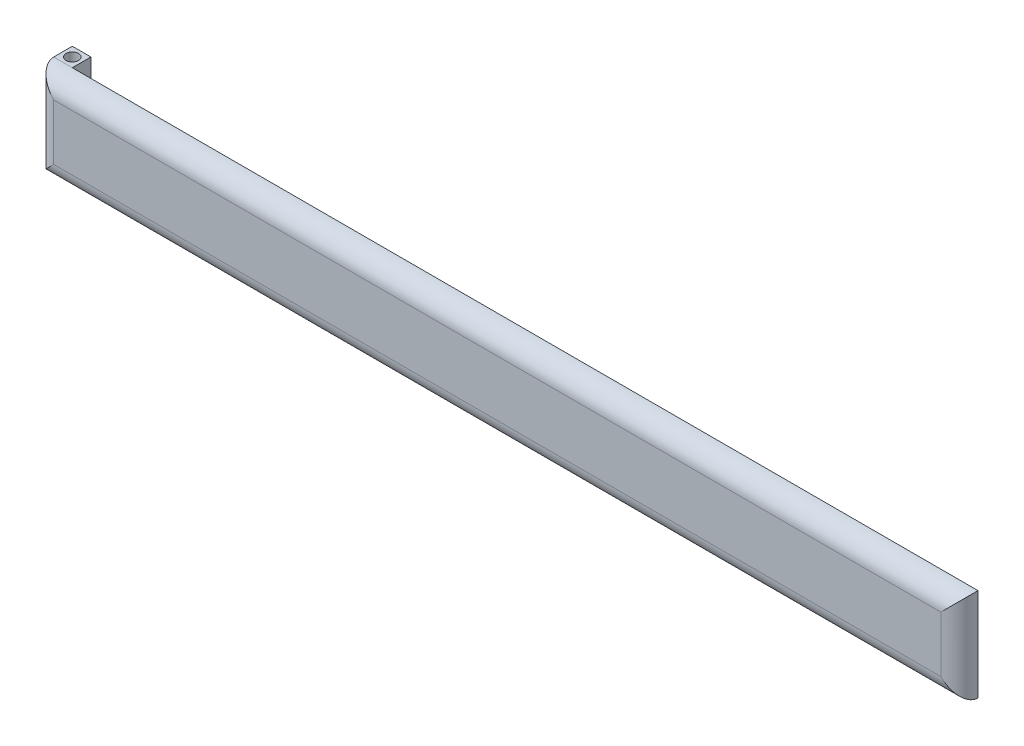
ISO-10303-21;
HEADER;
FILE_DESCRIPTION(('STEP AP214'),'2;1');
FILE_NAME('part.step','',(''),(''),'','','');
FILE_SCHEMA(('AUTOMOTIVE_DESIGN { 1 0 10303 214 1 1 1 1 }'));
ENDSEC;
DATA;
#1=APPLICATION_CONTEXT('core data for automotive mechanical design processes');
#2=APPLICATION_PROTOCOL_DEFINITION('international standard','automotive_design',2000,#1);
#3=PRODUCT_CONTEXT('',#1,'mechanical');
#4=PRODUCT('Part','Part','',(#3));
#5=PRODUCT_RELATED_PRODUCT_CATEGORY('part','',(#4));
#6=PRODUCT_DEFINITION_FORMATION('','',#4);
#7=PRODUCT_DEFINITION_CONTEXT('part definition',#1,'design');
#8=PRODUCT_DEFINITION('design','',#6,#7);
#9=PRODUCT_DEFINITION_SHAPE('','',#8);
#10=(LENGTH_UNIT() NAMED_UNIT(*) SI_UNIT(.MILLI.,.METRE.));
#11=(NAMED_UNIT(*) PLANE_ANGLE_UNIT() SI_UNIT($,.RADIAN.));
#12=(NAMED_UNIT(*) SI_UNIT($,.STERADIAN.) SOLID_ANGLE_UNIT());
#13=UNCERTAINTY_MEASURE_WITH_UNIT(LENGTH_MEASURE(1.E-05),#10,'distance_accuracy_value','');
#14=(GEOMETRIC_REPRESENTATION_CONTEXT(3) GLOBAL_UNCERTAINTY_ASSIGNED_CONTEXT((#13)) GLOBAL_UNIT_ASSIGNED_CONTEXT((#10,
#11,#12)) REPRESENTATION_CONTEXT('',''));
#15=CARTESIAN_POINT('',(0.,0.,0.));
#16=DIRECTION('',(0.,0.,1.));
#17=DIRECTION('',(1.,0.,0.));
#18=AXIS2_PLACEMENT_3D('',#15,#16,#17);
#19=CARTESIAN_POINT('',(1.5,7.5,6.));
#20=DIRECTION('',(-1.,0.,0.));
#21=DIRECTION('',(0.,-1.,0.));
#22=AXIS2_PLACEMENT_3D('',#19,#20,#21);
#23=PLANE('',#22);
#24=DIRECTION('',(0.,1.,0.));
#25=VECTOR('',#24,1.);
#26=CARTESIAN_POINT('',(1.5,-7.5,3.));
#27=LINE('',#26,#25);
#28=CARTESIAN_POINT('',(1.5,-7.5,3.));
#29=VERTEX_POINT('',#28);
#30=CARTESIAN_POINT('',(1.5,7.5,3.));
#31=VERTEX_POINT('',#30);
#32=EDGE_CURVE('E105',#29,#31,#27,.T.);
#33=ORIENTED_EDGE('',*,*,#32,.F.);
#34=DIRECTION('',(0.,0.,-1.));
#35=VECTOR('',#34,1.);
#36=CARTESIAN_POINT('',(1.5,-7.5,6.));
#37=LINE('',#36,#35);
#38=CARTESIAN_POINT('',(1.5,-7.5,0.));
#39=VERTEX_POINT('',#38);
#40=EDGE_CURVE('E169',#29,#39,#37,.T.);
#41=ORIENTED_EDGE('',*,*,#40,.T.);
#42=DIRECTION('',(0.,1.,0.));
#43=VECTOR('',#42,1.);
#44=CARTESIAN_POINT('',(1.5,7.5,0.));
#45=LINE('',#44,#43);
#46=CARTESIAN_POINT('',(1.5,7.5,0.));
#47=VERTEX_POINT('',#46);
#48=EDGE_CURVE('E115',#39,#47,#45,.T.);
#49=ORIENTED_EDGE('',*,*,#48,.T.);
#50=DIRECTION('',(0.,0.,-1.));
#51=VECTOR('',#50,1.);
#52=CARTESIAN_POINT('',(1.5,7.5,6.));
#53=LINE('',#52,#51);
#54=EDGE_CURVE('E132',#31,#47,#53,.T.);
#55=ORIENTED_EDGE('',*,*,#54,.F.);
#56=EDGE_LOOP('',(#33,#41,#49,#55));
#57=FACE_BOUND('',#56,.T.);
#58=ADVANCED_FACE('F32',(#57),#23,.F.);
#59=CARTESIAN_POINT('',(-1.5,7.5,6.));
#60=DIRECTION('',(0.,-1.,0.));
#61=DIRECTION('',(0.,0.,-1.));
#62=AXIS2_PLACEMENT_3D('',#59,#60,#61);
#63=PLANE('',#62);
#64=CARTESIAN_POINT('',(0.,7.5,1.5));
#65=DIRECTION('',(0.,1.,0.));
#66=DIRECTION('',(0.,0.,1.));
#67=AXIS2_PLACEMENT_3D('',#64,#65,#66);
#68=CIRCLE('',#67,1.);
#69=CARTESIAN_POINT('',(0.,7.5,2.5));
#70=VERTEX_POINT('',#69);
#71=EDGE_CURVE('E129',#70,#70,#68,.T.);
#72=ORIENTED_EDGE('',*,*,#71,.F.);
#73=EDGE_LOOP('',(#72));
#74=FACE_BOUND('',#73,.T.);
#75=DIRECTION('',(0.,0.,-1.));
#76=VECTOR('',#75,1.);
#77=CARTESIAN_POINT('',(-1.5,7.5,6.));
#78=LINE('',#77,#76);
#79=CARTESIAN_POINT('',(-1.5,7.5,3.));
#80=VERTEX_POINT('',#79);
#81=CARTESIAN_POINT('',(-1.5,7.5,0.));
#82=VERTEX_POINT('',#81);
#83=EDGE_CURVE('E161',#80,#82,#78,.T.);
#84=ORIENTED_EDGE('',*,*,#83,.F.);
#85=DIRECTION('',(-1.,0.,0.));
#86=VECTOR('',#85,1.);
#87=CARTESIAN_POINT('',(147.5,7.5,3.));
#88=LINE('',#87,#86);
#89=EDGE_CURVE('E41',#80,#31,#88,.F.);
#90=ORIENTED_EDGE('',*,*,#89,.T.);
#91=ORIENTED_EDGE('',*,*,#54,.T.);
#92=DIRECTION('',(-1.,0.,0.));
#93=VECTOR('',#92,1.);
#94=CARTESIAN_POINT('',(-1.5,7.5,0.));
#95=LINE('',#94,#93);
#96=EDGE_CURVE('E118',#47,#82,#95,.T.);
#97=ORIENTED_EDGE('',*,*,#96,.T.);
#98=EDGE_LOOP('',(#84,#90,#91,#97));
#99=FACE_BOUND('',#98,.T.);
#100=ADVANCED_FACE('F164',(#74,#99),#63,.F.);
#101=CARTESIAN_POINT('',(-1.5,7.5,6.));
#102=DIRECTION('',(1.,0.,0.));
#103=DIRECTION('',(0.,1.,0.));
#104=AXIS2_PLACEMENT_3D('',#101,#102,#103);
#105=PLANE('',#104);
#106=DIRECTION('',(0.,0.,-1.));
#107=VECTOR('',#106,1.);
#108=CARTESIAN_POINT('',(-1.5,-7.5,6.));
#109=LINE('',#108,#107);
#110=CARTESIAN_POINT('',(-1.5,-7.5,3.));
#111=VERTEX_POINT('',#110);
#112=CARTESIAN_POINT('',(-1.5,-7.5,0.));
#113=VERTEX_POINT('',#112);
#114=EDGE_CURVE('E163',#111,#113,#109,.T.);
#115=ORIENTED_EDGE('',*,*,#114,.F.);
#116=DIRECTION('',(0.,-1.,0.));
#117=VECTOR('',#116,1.);
#118=CARTESIAN_POINT('',(-1.5,7.5,3.));
#119=LINE('',#118,#117);
#120=EDGE_CURVE('E139',#111,#80,#119,.F.);
#121=ORIENTED_EDGE('',*,*,#120,.T.);
#122=ORIENTED_EDGE('',*,*,#83,.T.);
#123=DIRECTION('',(0.,-1.,0.));
#124=VECTOR('',#123,1.);
#125=CARTESIAN_POINT('',(-1.5,7.5,0.));
#126=LINE('',#125,#124);
#127=EDGE_CURVE('E182',#82,#113,#126,.T.);
#128=ORIENTED_EDGE('',*,*,#127,.T.);
#129=EDGE_LOOP('',(#115,#121,#122,#128));
#130=FACE_BOUND('',#129,.T.);
#131=ADVANCED_FACE('F159',(#130),#105,.F.);
#132=CARTESIAN_POINT('',(-1.5,-7.5,6.));
#133=DIRECTION('',(0.,1.,0.));
#134=DIRECTION('',(0.,0.,1.));
#135=AXIS2_PLACEMENT_3D('',#132,#133,#134);
#136=PLANE('',#135);
#137=CARTESIAN_POINT('',(0.,-7.50000000000001,1.5));
#138=DIRECTION('',(0.,1.,0.));
#139=DIRECTION('',(0.,0.,1.));
#140=AXIS2_PLACEMENT_3D('',#137,#138,#139);
#141=CIRCLE('',#140,1.);
#142=CARTESIAN_POINT('',(0.,-7.50000000000001,2.5));
#143=VERTEX_POINT('',#142);
#144=EDGE_CURVE('E126',#143,#143,#141,.T.);
#145=ORIENTED_EDGE('',*,*,#144,.T.);
#146=EDGE_LOOP('',(#145));
#147=FACE_BOUND('',#146,.T.);
#148=ORIENTED_EDGE('',*,*,#40,.F.);
#149=DIRECTION('',(1.,0.,0.));
#150=VECTOR('',#149,1.);
#151=CARTESIAN_POINT('',(-1.5,-7.5,3.));
#152=LINE('',#151,#150);
#153=EDGE_CURVE('E11',#29,#111,#152,.F.);
#154=ORIENTED_EDGE('',*,*,#153,.T.);
#155=ORIENTED_EDGE('',*,*,#114,.T.);
#156=DIRECTION('',(1.,0.,0.));
#157=VECTOR('',#156,1.);
#158=CARTESIAN_POINT('',(-1.5,-7.5,0.));
#159=LINE('',#158,#157);
#160=EDGE_CURVE('E176',#113,#39,#159,.T.);
#161=ORIENTED_EDGE('',*,*,#160,.T.);
#162=EDGE_LOOP('',(#148,#154,#155,#161));
#163=FACE_BOUND('',#162,.T.);
#164=ADVANCED_FACE('F198',(#147,#163),#136,.F.);
#165=CARTESIAN_POINT('',(1.5,-7.5,6.));
#166=DIRECTION('',(0.,0.,1.));
#167=DIRECTION('',(1.,0.,0.));
#168=AXIS2_PLACEMENT_3D('',#165,#166,#167);
#169=PLANE('',#168);
#170=DIRECTION('',(-1.,0.,0.));
#171=VECTOR('',#170,1.);
#172=CARTESIAN_POINT('',(-1.5,4.5,6.));
#173=LINE('',#172,#171);
#174=CARTESIAN_POINT('',(144.5,4.5,6.));
#175=VERTEX_POINT('',#174);
#176=CARTESIAN_POINT('',(1.5,4.5,6.));
#177=VERTEX_POINT('',#176);
#178=EDGE_CURVE('E134',#175,#177,#173,.T.);
#179=ORIENTED_EDGE('',*,*,#178,.T.);
#180=DIRECTION('',(0.,-1.,0.));
#181=VECTOR('',#180,1.);
#182=CARTESIAN_POINT('',(1.5,-7.5,6.));
#183=LINE('',#182,#181);
#184=CARTESIAN_POINT('',(1.5,-4.5,6.));
#185=VERTEX_POINT('',#184);
#186=EDGE_CURVE('E136',#177,#185,#183,.T.);
#187=ORIENTED_EDGE('',*,*,#186,.T.);
#188=DIRECTION('',(1.,0.,0.));
#189=VECTOR('',#188,1.);
#190=CARTESIAN_POINT('',(147.5,-4.5,6.));
#191=LINE('',#190,#189);
#192=CARTESIAN_POINT('',(144.5,-4.5,6.));
#193=VERTEX_POINT('',#192);
#194=EDGE_CURVE('E130',#185,#193,#191,.T.);
#195=ORIENTED_EDGE('',*,*,#194,.T.);
#196=DIRECTION('',(0.,-1.,0.));
#197=VECTOR('',#196,1.);
#198=CARTESIAN_POINT('',(144.5,7.50000000000002,6.));
#199=LINE('',#198,#197);
#200=EDGE_CURVE('E110',#193,#175,#199,.F.);
#201=ORIENTED_EDGE('',*,*,#200,.T.);
#202=EDGE_LOOP('',(#179,#187,#195,#201));
#203=FACE_BOUND('',#202,.T.);
#204=ADVANCED_FACE('F151',(#203),#169,.T.);
#205=CARTESIAN_POINT('',(1.5,-7.5,0.));
#206=DIRECTION('',(0.,0.,1.));
#207=DIRECTION('',(1.,0.,0.));
#208=AXIS2_PLACEMENT_3D('',#205,#206,#207);
#209=PLANE('',#208);
#210=ORIENTED_EDGE('',*,*,#48,.F.);
#211=ORIENTED_EDGE('',*,*,#160,.F.);
#212=ORIENTED_EDGE('',*,*,#127,.F.);
#213=ORIENTED_EDGE('',*,*,#96,.F.);
#214=EDGE_LOOP('',(#210,#211,#212,#213));
#215=FACE_BOUND('',#214,.T.);
#216=ADVANCED_FACE('F218',(#215),#209,.F.);
#217=CARTESIAN_POINT('',(147.5,-7.49999999999998,3.));
#218=DIRECTION('',(0.,0.,1.));
#219=DIRECTION('',(1.,0.,0.));
#220=AXIS2_PLACEMENT_3D('',#217,#218,#219);
#221=PLANE('',#220);
#222=ORIENTED_EDGE('',*,*,#32,.T.);
#223=DIRECTION('',(-1.,0.,0.));
#224=VECTOR('',#223,1.);
#225=CARTESIAN_POINT('',(147.5,7.50000000000002,3.));
#226=LINE('',#225,#224);
#227=CARTESIAN_POINT('',(147.5,7.50000000000002,3.));
#228=VERTEX_POINT('',#227);
#229=EDGE_CURVE('E101',#228,#31,#226,.T.);
#230=ORIENTED_EDGE('',*,*,#229,.F.);
#231=DIRECTION('',(0.,1.,0.));
#232=VECTOR('',#231,1.);
#233=CARTESIAN_POINT('',(147.5,-7.49999999999998,3.));
#234=LINE('',#233,#232);
#235=CARTESIAN_POINT('',(147.5,-7.49999999999998,3.));
#236=VERTEX_POINT('',#235);
#237=EDGE_CURVE('E94',#236,#228,#234,.T.);
#238=ORIENTED_EDGE('',*,*,#237,.F.);
#239=DIRECTION('',(-1.,0.,0.));
#240=VECTOR('',#239,1.);
#241=CARTESIAN_POINT('',(147.5,-7.49999999999998,3.));
#242=LINE('',#241,#240);
#243=EDGE_CURVE('E99',#236,#29,#242,.T.);
#244=ORIENTED_EDGE('',*,*,#243,.T.);
#245=EDGE_LOOP('',(#222,#230,#238,#244));
#246=FACE_BOUND('',#245,.T.);
#247=ADVANCED_FACE('F97',(#246),#221,.F.);
#248=CARTESIAN_POINT('',(0.,-138.5,1.5));
#249=DIRECTION('',(0.,1.,0.));
#250=DIRECTION('',(0.,0.,1.));
#251=AXIS2_PLACEMENT_3D('',#248,#249,#250);
#252=CYLINDRICAL_SURFACE('',#251,1.);
#253=ORIENTED_EDGE('',*,*,#71,.T.);
#254=EDGE_LOOP('',(#253));
#255=FACE_BOUND('',#254,.T.);
#256=ORIENTED_EDGE('',*,*,#144,.F.);
#257=EDGE_LOOP('',(#256));
#258=FACE_BOUND('',#257,.T.);
#259=ADVANCED_FACE('F189',(#255,#258),#252,.F.);
#260=CARTESIAN_POINT('',(144.5,7.50000000000002,3.));
#261=DIRECTION('',(0.,1.,0.));
#262=DIRECTION('',(-1.,0.,0.));
#263=AXIS2_PLACEMENT_3D('',#260,#261,#262);
#264=CYLINDRICAL_SURFACE('',#263,3.);
#265=CARTESIAN_POINT('',(144.5,-4.5,3.));
#266=DIRECTION('',(-0.707106781186547,-0.707106781186548,0.));
#267=DIRECTION('',(-0.707106781186548,0.707106781186547,0.));
#268=AXIS2_PLACEMENT_3D('',#265,#266,#267);
#269=ELLIPSE('',#268,4.24264068711929,3.);
#270=EDGE_CURVE('E109',#236,#193,#269,.T.);
#271=ORIENTED_EDGE('',*,*,#270,.F.);
#272=ORIENTED_EDGE('',*,*,#237,.T.);
#273=CARTESIAN_POINT('',(144.5,4.5,3.));
#274=DIRECTION('',(-0.707106781186548,0.707106781186547,0.));
#275=DIRECTION('',(0.707106781186547,0.707106781186548,0.));
#276=AXIS2_PLACEMENT_3D('',#273,#274,#275);
#277=ELLIPSE('',#276,4.24264068711928,3.);
#278=EDGE_CURVE('E36',#175,#228,#277,.T.);
#279=ORIENTED_EDGE('',*,*,#278,.F.);
#280=ORIENTED_EDGE('',*,*,#200,.F.);
#281=EDGE_LOOP('',(#271,#272,#279,#280));
#282=FACE_BOUND('',#281,.T.);
#283=ADVANCED_FACE('F34',(#282),#264,.T.);
#284=CARTESIAN_POINT('',(1.5,4.5,3.));
#285=DIRECTION('',(1.,0.,0.));
#286=DIRECTION('',(0.,0.,-1.));
#287=AXIS2_PLACEMENT_3D('',#284,#285,#286);
#288=CYLINDRICAL_SURFACE('',#287,3.);
#289=ORIENTED_EDGE('',*,*,#229,.T.);
#290=ORIENTED_EDGE('',*,*,#89,.F.);
#291=CARTESIAN_POINT('',(1.5,4.5,3.));
#292=DIRECTION('',(0.707106781186547,0.707106781186548,0.));
#293=DIRECTION('',(0.707106781186548,-0.707106781186547,0.));
#294=AXIS2_PLACEMENT_3D('',#291,#292,#293);
#295=ELLIPSE('',#294,4.24264068711929,3.);
#296=EDGE_CURVE('E49',#177,#80,#295,.F.);
#297=ORIENTED_EDGE('',*,*,#296,.F.);
#298=ORIENTED_EDGE('',*,*,#178,.F.);
#299=ORIENTED_EDGE('',*,*,#278,.T.);
#300=EDGE_LOOP('',(#289,#290,#297,#298,#299));
#301=FACE_BOUND('',#300,.T.);
#302=ADVANCED_FACE('F154',(#301),#288,.T.);
#303=CARTESIAN_POINT('',(1.5,-4.5,3.));
#304=DIRECTION('',(-1.,0.,0.));
#305=DIRECTION('',(0.,0.,1.));
#306=AXIS2_PLACEMENT_3D('',#303,#304,#305);
#307=CYLINDRICAL_SURFACE('',#306,3.);
#308=ORIENTED_EDGE('',*,*,#270,.T.);
#309=ORIENTED_EDGE('',*,*,#194,.F.);
#310=CARTESIAN_POINT('',(1.5,-4.5,3.));
#311=DIRECTION('',(-0.707106781186548,0.707106781186547,0.));
#312=DIRECTION('',(-0.707106781186547,-0.707106781186548,0.));
#313=AXIS2_PLACEMENT_3D('',#310,#311,#312);
#314=ELLIPSE('',#313,4.24264068711928,3.);
#315=EDGE_CURVE('E147',#111,#185,#314,.T.);
#316=ORIENTED_EDGE('',*,*,#315,.F.);
#317=ORIENTED_EDGE('',*,*,#153,.F.);
#318=ORIENTED_EDGE('',*,*,#243,.F.);
#319=EDGE_LOOP('',(#308,#309,#316,#317,#318));
#320=FACE_BOUND('',#319,.T.);
#321=ADVANCED_FACE('F113',(#320),#307,.T.);
#322=CARTESIAN_POINT('',(1.5,-7.5,3.));
#323=DIRECTION('',(0.,1.,0.));
#324=DIRECTION('',(-1.,0.,0.));
#325=AXIS2_PLACEMENT_3D('',#322,#323,#324);
#326=CYLINDRICAL_SURFACE('',#325,3.);
#327=ORIENTED_EDGE('',*,*,#296,.T.);
#328=ORIENTED_EDGE('',*,*,#120,.F.);
#329=ORIENTED_EDGE('',*,*,#315,.T.);
#330=ORIENTED_EDGE('',*,*,#186,.F.);
#331=EDGE_LOOP('',(#327,#328,#329,#330));
#332=FACE_BOUND('',#331,.T.);
#333=ADVANCED_FACE('F149',(#332),#326,.T.);
#334=CLOSED_SHELL('',(#58,#100,#131,#164,#204,#216,#247,#259,#283,#302,#321,#333));
#335=MANIFOLD_SOLID_BREP('B2',#334);
#336=ADVANCED_BREP_SHAPE_REPRESENTATION('',(#18,#335),#14);
#337=SHAPE_DEFINITION_REPRESENTATION(#9,#336);
ENDSEC;
END-ISO-10303-21;
